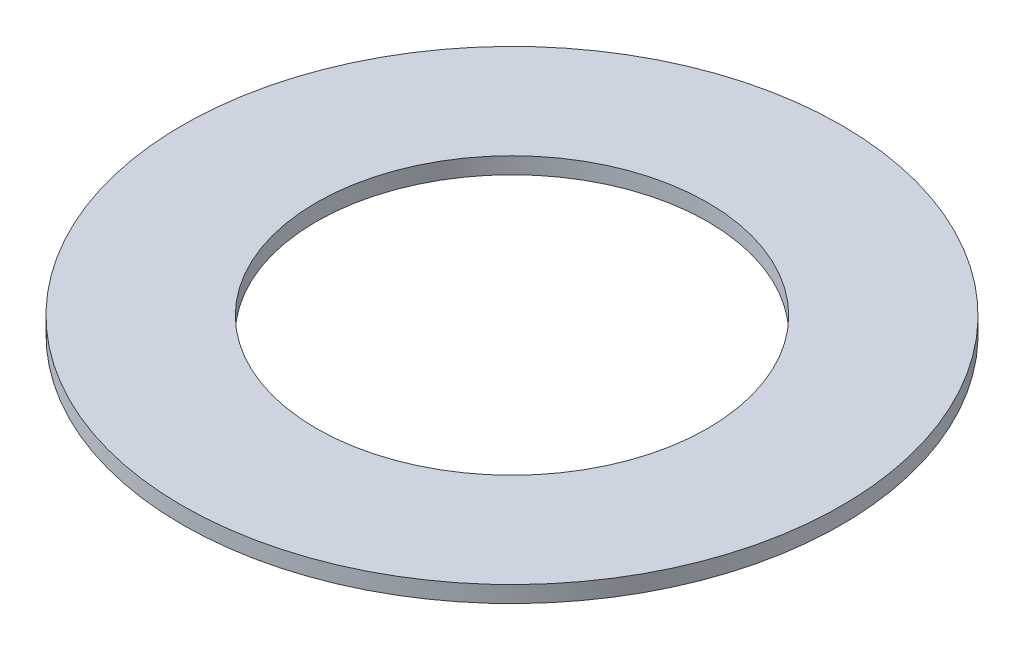
ISO-10303-21;
HEADER;
FILE_DESCRIPTION(('STEP AP214'),'2;1');
FILE_NAME('part.step','',(''),(''),'','','');
FILE_SCHEMA(('AUTOMOTIVE_DESIGN { 1 0 10303 214 1 1 1 1 }'));
ENDSEC;
DATA;
#1=APPLICATION_CONTEXT('core data for automotive mechanical design processes');
#2=APPLICATION_PROTOCOL_DEFINITION('international standard','automotive_design',2000,#1);
#3=PRODUCT_CONTEXT('',#1,'mechanical');
#4=PRODUCT('Part','Part','',(#3));
#5=PRODUCT_RELATED_PRODUCT_CATEGORY('part','',(#4));
#6=PRODUCT_DEFINITION_FORMATION('','',#4);
#7=PRODUCT_DEFINITION_CONTEXT('part definition',#1,'design');
#8=PRODUCT_DEFINITION('design','',#6,#7);
#9=PRODUCT_DEFINITION_SHAPE('','',#8);
#10=(LENGTH_UNIT() NAMED_UNIT(*) SI_UNIT(.MILLI.,.METRE.));
#11=(NAMED_UNIT(*) PLANE_ANGLE_UNIT() SI_UNIT($,.RADIAN.));
#12=(NAMED_UNIT(*) SI_UNIT($,.STERADIAN.) SOLID_ANGLE_UNIT());
#13=UNCERTAINTY_MEASURE_WITH_UNIT(LENGTH_MEASURE(1.E-05),#10,'distance_accuracy_value','');
#14=(GEOMETRIC_REPRESENTATION_CONTEXT(3) GLOBAL_UNCERTAINTY_ASSIGNED_CONTEXT((#13)) GLOBAL_UNIT_ASSIGNED_CONTEXT((#10,
#11,#12)) REPRESENTATION_CONTEXT('',''));
#15=CARTESIAN_POINT('',(0.,0.,0.));
#16=DIRECTION('',(0.,0.,1.));
#17=DIRECTION('',(1.,0.,0.));
#18=AXIS2_PLACEMENT_3D('',#15,#16,#17);
#19=CARTESIAN_POINT('',(0.,4.,0.));
#20=DIRECTION('',(0.,-1.,0.));
#21=DIRECTION('',(0.,0.,-1.));
#22=AXIS2_PLACEMENT_3D('',#19,#20,#21);
#23=CYLINDRICAL_SURFACE('',#22,80.);
#24=CARTESIAN_POINT('',(0.,4.,0.));
#25=DIRECTION('',(0.,1.,0.));
#26=DIRECTION('',(0.,0.,1.));
#27=AXIS2_PLACEMENT_3D('',#24,#25,#26);
#28=CIRCLE('',#27,80.);
#29=CARTESIAN_POINT('',(0.,4.,80.));
#30=VERTEX_POINT('',#29);
#31=EDGE_CURVE('E10',#30,#30,#28,.T.);
#32=ORIENTED_EDGE('',*,*,#31,.F.);
#33=EDGE_LOOP('',(#32));
#34=FACE_BOUND('',#33,.T.);
#35=CARTESIAN_POINT('',(0.,0.,0.));
#36=DIRECTION('',(0.,1.,0.));
#37=DIRECTION('',(0.,0.,1.));
#38=AXIS2_PLACEMENT_3D('',#35,#36,#37);
#39=CIRCLE('',#38,80.);
#40=CARTESIAN_POINT('',(0.,0.,80.));
#41=VERTEX_POINT('',#40);
#42=EDGE_CURVE('E37',#41,#41,#39,.T.);
#43=ORIENTED_EDGE('',*,*,#42,.T.);
#44=EDGE_LOOP('',(#43));
#45=FACE_BOUND('',#44,.T.);
#46=ADVANCED_FACE('F40',(#34,#45),#23,.T.);
#47=CARTESIAN_POINT('',(0.,4.,0.));
#48=DIRECTION('',(0.,1.,0.));
#49=DIRECTION('',(0.,0.,1.));
#50=AXIS2_PLACEMENT_3D('',#47,#48,#49);
#51=PLANE('',#50);
#52=CARTESIAN_POINT('',(0.,4.,0.));
#53=DIRECTION('',(0.,1.,0.));
#54=DIRECTION('',(0.,0.,1.));
#55=AXIS2_PLACEMENT_3D('',#52,#53,#54);
#56=CIRCLE('',#55,47.5);
#57=CARTESIAN_POINT('',(0.,4.,47.5));
#58=VERTEX_POINT('',#57);
#59=EDGE_CURVE('E50',#58,#58,#56,.T.);
#60=ORIENTED_EDGE('',*,*,#59,.F.);
#61=EDGE_LOOP('',(#60));
#62=FACE_BOUND('',#61,.T.);
#63=ORIENTED_EDGE('',*,*,#31,.T.);
#64=EDGE_LOOP('',(#63));
#65=FACE_BOUND('',#64,.T.);
#66=ADVANCED_FACE('F59',(#62,#65),#51,.T.);
#67=CARTESIAN_POINT('',(0.,0.,0.));
#68=DIRECTION('',(0.,1.,0.));
#69=DIRECTION('',(0.,0.,1.));
#70=AXIS2_PLACEMENT_3D('',#67,#68,#69);
#71=PLANE('',#70);
#72=CARTESIAN_POINT('',(0.,0.,0.));
#73=DIRECTION('',(0.,1.,0.));
#74=DIRECTION('',(0.,0.,1.));
#75=AXIS2_PLACEMENT_3D('',#72,#73,#74);
#76=CIRCLE('',#75,47.5);
#77=CARTESIAN_POINT('',(0.,0.,47.5));
#78=VERTEX_POINT('',#77);
#79=EDGE_CURVE('E47',#78,#78,#76,.T.);
#80=ORIENTED_EDGE('',*,*,#79,.T.);
#81=EDGE_LOOP('',(#80));
#82=FACE_BOUND('',#81,.T.);
#83=ORIENTED_EDGE('',*,*,#42,.F.);
#84=EDGE_LOOP('',(#83));
#85=FACE_BOUND('',#84,.T.);
#86=ADVANCED_FACE('F58',(#82,#85),#71,.F.);
#87=CARTESIAN_POINT('',(0.,4.,0.));
#88=DIRECTION('',(0.,-1.,0.));
#89=DIRECTION('',(0.,0.,-1.));
#90=AXIS2_PLACEMENT_3D('',#87,#88,#89);
#91=CYLINDRICAL_SURFACE('',#90,47.5);
#92=ORIENTED_EDGE('',*,*,#59,.T.);
#93=EDGE_LOOP('',(#92));
#94=FACE_BOUND('',#93,.T.);
#95=ORIENTED_EDGE('',*,*,#79,.F.);
#96=EDGE_LOOP('',(#95));
#97=FACE_BOUND('',#96,.T.);
#98=ADVANCED_FACE('F54',(#94,#97),#91,.F.);
#99=CLOSED_SHELL('',(#46,#66,#86,#98));
#100=MANIFOLD_SOLID_BREP('B2',#99);
#101=ADVANCED_BREP_SHAPE_REPRESENTATION('',(#18,#100),#14);
#102=SHAPE_DEFINITION_REPRESENTATION(#9,#101);
ENDSEC;
END-ISO-10303-21;
